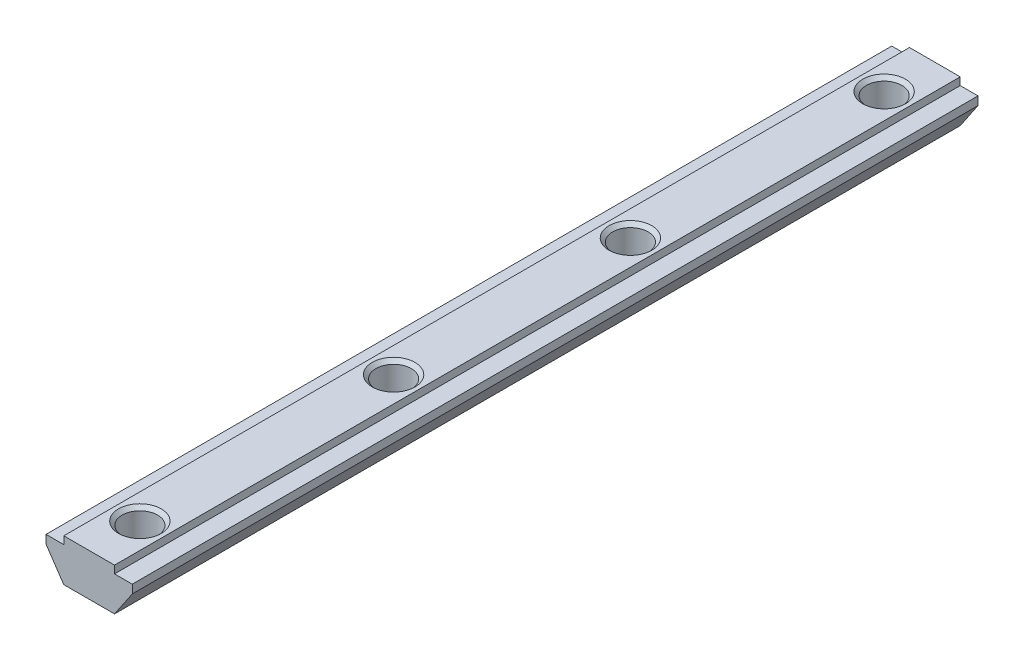
ISO-10303-21;
HEADER;
FILE_DESCRIPTION(('STEP AP214'),'2;1');
FILE_NAME('part.step','',(''),(''),'','','');
FILE_SCHEMA(('AUTOMOTIVE_DESIGN { 1 0 10303 214 1 1 1 1 }'));
ENDSEC;
DATA;
#1=APPLICATION_CONTEXT('core data for automotive mechanical design processes');
#2=APPLICATION_PROTOCOL_DEFINITION('international standard','automotive_design',2000,#1);
#3=PRODUCT_CONTEXT('',#1,'mechanical');
#4=PRODUCT('Part','Part','',(#3));
#5=PRODUCT_RELATED_PRODUCT_CATEGORY('part','',(#4));
#6=PRODUCT_DEFINITION_FORMATION('','',#4);
#7=PRODUCT_DEFINITION_CONTEXT('part definition',#1,'design');
#8=PRODUCT_DEFINITION('design','',#6,#7);
#9=PRODUCT_DEFINITION_SHAPE('','',#8);
#10=(LENGTH_UNIT() NAMED_UNIT(*) SI_UNIT(.MILLI.,.METRE.));
#11=(NAMED_UNIT(*) PLANE_ANGLE_UNIT() SI_UNIT($,.RADIAN.));
#12=(NAMED_UNIT(*) SI_UNIT($,.STERADIAN.) SOLID_ANGLE_UNIT());
#13=UNCERTAINTY_MEASURE_WITH_UNIT(LENGTH_MEASURE(1.E-05),#10,'distance_accuracy_value','');
#14=(GEOMETRIC_REPRESENTATION_CONTEXT(3) GLOBAL_UNCERTAINTY_ASSIGNED_CONTEXT((#13)) GLOBAL_UNIT_ASSIGNED_CONTEXT((#10,
#11,#12)) REPRESENTATION_CONTEXT('',''));
#15=CARTESIAN_POINT('',(0.,0.,0.));
#16=DIRECTION('',(0.,0.,1.));
#17=DIRECTION('',(1.,0.,0.));
#18=AXIS2_PLACEMENT_3D('',#15,#16,#17);
#19=CARTESIAN_POINT('',(3.,0.,50.));
#20=DIRECTION('',(0.,-1.,0.));
#21=DIRECTION('',(0.,0.,-1.));
#22=AXIS2_PLACEMENT_3D('',#19,#20,#21);
#23=PLANE('',#22);
#24=CARTESIAN_POINT('',(0.,0.,-44.));
#25=DIRECTION('',(0.,1.,0.));
#26=DIRECTION('',(0.,0.,1.));
#27=AXIS2_PLACEMENT_3D('',#24,#25,#26);
#28=CIRCLE('',#27,2.525);
#29=CARTESIAN_POINT('',(0.,0.,-41.475));
#30=VERTEX_POINT('',#29);
#31=EDGE_CURVE('E253',#30,#30,#28,.T.);
#32=ORIENTED_EDGE('',*,*,#31,.F.);
#33=EDGE_LOOP('',(#32));
#34=FACE_BOUND('',#33,.T.);
#35=CARTESIAN_POINT('',(0.,0.,14.));
#36=DIRECTION('',(0.,1.,0.));
#37=DIRECTION('',(0.,0.,1.));
#38=AXIS2_PLACEMENT_3D('',#35,#36,#37);
#39=CIRCLE('',#38,2.525);
#40=CARTESIAN_POINT('',(0.,0.,16.525));
#41=VERTEX_POINT('',#40);
#42=EDGE_CURVE('E229',#41,#41,#39,.T.);
#43=ORIENTED_EDGE('',*,*,#42,.F.);
#44=EDGE_LOOP('',(#43));
#45=FACE_BOUND('',#44,.T.);
#46=CARTESIAN_POINT('',(0.,0.,44.));
#47=DIRECTION('',(0.,1.,0.));
#48=DIRECTION('',(0.,0.,1.));
#49=AXIS2_PLACEMENT_3D('',#46,#47,#48);
#50=CIRCLE('',#49,2.525);
#51=CARTESIAN_POINT('',(0.,0.,46.525));
#52=VERTEX_POINT('',#51);
#53=EDGE_CURVE('E217',#52,#52,#50,.T.);
#54=ORIENTED_EDGE('',*,*,#53,.F.);
#55=EDGE_LOOP('',(#54));
#56=FACE_BOUND('',#55,.T.);
#57=DIRECTION('',(-1.,0.,0.));
#58=VECTOR('',#57,1.);
#59=CARTESIAN_POINT('',(3.,0.,-50.));
#60=LINE('',#59,#58);
#61=CARTESIAN_POINT('',(3.,0.,-50.));
#62=VERTEX_POINT('',#61);
#63=CARTESIAN_POINT('',(-3.,0.,-50.));
#64=VERTEX_POINT('',#63);
#65=EDGE_CURVE('E95',#62,#64,#60,.T.);
#66=ORIENTED_EDGE('',*,*,#65,.T.);
#67=DIRECTION('',(0.,0.,-1.));
#68=VECTOR('',#67,1.);
#69=CARTESIAN_POINT('',(-3.,0.,50.));
#70=LINE('',#69,#68);
#71=CARTESIAN_POINT('',(-3.,0.,50.));
#72=VERTEX_POINT('',#71);
#73=EDGE_CURVE('E142',#72,#64,#70,.T.);
#74=ORIENTED_EDGE('',*,*,#73,.F.);
#75=DIRECTION('',(-1.,0.,0.));
#76=VECTOR('',#75,1.);
#77=CARTESIAN_POINT('',(3.,0.,50.));
#78=LINE('',#77,#76);
#79=CARTESIAN_POINT('',(3.,0.,50.));
#80=VERTEX_POINT('',#79);
#81=EDGE_CURVE('E54',#80,#72,#78,.T.);
#82=ORIENTED_EDGE('',*,*,#81,.F.);
#83=DIRECTION('',(0.,0.,-1.));
#84=VECTOR('',#83,1.);
#85=CARTESIAN_POINT('',(3.,0.,50.));
#86=LINE('',#85,#84);
#87=EDGE_CURVE('E138',#80,#62,#86,.T.);
#88=ORIENTED_EDGE('',*,*,#87,.T.);
#89=EDGE_LOOP('',(#66,#74,#82,#88));
#90=FACE_BOUND('',#89,.T.);
#91=CARTESIAN_POINT('',(0.,0.,-14.));
#92=DIRECTION('',(0.,1.,0.));
#93=DIRECTION('',(0.,0.,1.));
#94=AXIS2_PLACEMENT_3D('',#91,#92,#93);
#95=CIRCLE('',#94,2.525);
#96=CARTESIAN_POINT('',(0.,0.,-11.475));
#97=VERTEX_POINT('',#96);
#98=EDGE_CURVE('E241',#97,#97,#95,.T.);
#99=ORIENTED_EDGE('',*,*,#98,.F.);
#100=EDGE_LOOP('',(#99));
#101=FACE_BOUND('',#100,.T.);
#102=ADVANCED_FACE('F37',(#34,#45,#56,#90,#101),#23,.F.);
#103=CARTESIAN_POINT('',(-3.,0.,50.));
#104=DIRECTION('',(1.,0.,0.));
#105=DIRECTION('',(0.,1.,0.));
#106=AXIS2_PLACEMENT_3D('',#103,#104,#105);
#107=PLANE('',#106);
#108=DIRECTION('',(0.,-1.,0.));
#109=VECTOR('',#108,1.);
#110=CARTESIAN_POINT('',(-3.,0.,-50.));
#111=LINE('',#110,#109);
#112=CARTESIAN_POINT('',(-3.,-0.900000000000001,-50.));
#113=VERTEX_POINT('',#112);
#114=EDGE_CURVE('E146',#64,#113,#111,.T.);
#115=ORIENTED_EDGE('',*,*,#114,.T.);
#116=DIRECTION('',(0.,0.,-1.));
#117=VECTOR('',#116,1.);
#118=CARTESIAN_POINT('',(-3.,-0.900000000000001,50.));
#119=LINE('',#118,#117);
#120=CARTESIAN_POINT('',(-3.,-0.900000000000001,50.));
#121=VERTEX_POINT('',#120);
#122=EDGE_CURVE('E11',#121,#113,#119,.T.);
#123=ORIENTED_EDGE('',*,*,#122,.F.);
#124=DIRECTION('',(0.,-1.,0.));
#125=VECTOR('',#124,1.);
#126=CARTESIAN_POINT('',(-3.,0.,50.));
#127=LINE('',#126,#125);
#128=EDGE_CURVE('E165',#72,#121,#127,.T.);
#129=ORIENTED_EDGE('',*,*,#128,.F.);
#130=ORIENTED_EDGE('',*,*,#73,.T.);
#131=EDGE_LOOP('',(#115,#123,#129,#130));
#132=FACE_BOUND('',#131,.T.);
#133=ADVANCED_FACE('F39',(#132),#107,.F.);
#134=CARTESIAN_POINT('',(-3.,-0.900000000000001,50.));
#135=DIRECTION('',(0.,-1.,0.));
#136=DIRECTION('',(1.,0.,0.));
#137=AXIS2_PLACEMENT_3D('',#134,#135,#136);
#138=PLANE('',#137);
#139=DIRECTION('',(-1.,0.,0.));
#140=VECTOR('',#139,1.);
#141=CARTESIAN_POINT('',(-3.,-0.900000000000001,-50.));
#142=LINE('',#141,#140);
#143=CARTESIAN_POINT('',(-5.1,-0.900000000000002,-50.));
#144=VERTEX_POINT('',#143);
#145=EDGE_CURVE('E149',#113,#144,#142,.T.);
#146=ORIENTED_EDGE('',*,*,#145,.T.);
#147=DIRECTION('',(0.,0.,-1.));
#148=VECTOR('',#147,1.);
#149=CARTESIAN_POINT('',(-5.1,-0.900000000000002,50.));
#150=LINE('',#149,#148);
#151=CARTESIAN_POINT('',(-5.1,-0.900000000000002,50.));
#152=VERTEX_POINT('',#151);
#153=EDGE_CURVE('E46',#152,#144,#150,.T.);
#154=ORIENTED_EDGE('',*,*,#153,.F.);
#155=DIRECTION('',(-1.,0.,0.));
#156=VECTOR('',#155,1.);
#157=CARTESIAN_POINT('',(-3.,-0.900000000000001,50.));
#158=LINE('',#157,#156);
#159=EDGE_CURVE('E103',#121,#152,#158,.T.);
#160=ORIENTED_EDGE('',*,*,#159,.F.);
#161=ORIENTED_EDGE('',*,*,#122,.T.);
#162=EDGE_LOOP('',(#146,#154,#160,#161));
#163=FACE_BOUND('',#162,.T.);
#164=ADVANCED_FACE('F350',(#163),#138,.F.);
#165=CARTESIAN_POINT('',(-5.1,-0.900000000000002,50.));
#166=DIRECTION('',(1.,0.,0.));
#167=DIRECTION('',(0.,0.,-1.));
#168=AXIS2_PLACEMENT_3D('',#165,#166,#167);
#169=PLANE('',#168);
#170=DIRECTION('',(0.,-1.,0.));
#171=VECTOR('',#170,1.);
#172=CARTESIAN_POINT('',(-5.1,-0.900000000000002,-50.));
#173=LINE('',#172,#171);
#174=CARTESIAN_POINT('',(-5.1,-1.9,-50.));
#175=VERTEX_POINT('',#174);
#176=EDGE_CURVE('E152',#144,#175,#173,.T.);
#177=ORIENTED_EDGE('',*,*,#176,.T.);
#178=DIRECTION('',(0.,0.,-1.));
#179=VECTOR('',#178,1.);
#180=CARTESIAN_POINT('',(-5.1,-1.9,50.));
#181=LINE('',#180,#179);
#182=CARTESIAN_POINT('',(-5.1,-1.9,50.));
#183=VERTEX_POINT('',#182);
#184=EDGE_CURVE('E178',#183,#175,#181,.T.);
#185=ORIENTED_EDGE('',*,*,#184,.F.);
#186=DIRECTION('',(0.,-1.,0.));
#187=VECTOR('',#186,1.);
#188=CARTESIAN_POINT('',(-5.1,-0.900000000000002,50.));
#189=LINE('',#188,#187);
#190=EDGE_CURVE('E186',#152,#183,#189,.T.);
#191=ORIENTED_EDGE('',*,*,#190,.F.);
#192=ORIENTED_EDGE('',*,*,#153,.T.);
#193=EDGE_LOOP('',(#177,#185,#191,#192));
#194=FACE_BOUND('',#193,.T.);
#195=ADVANCED_FACE('F184',(#194),#169,.F.);
#196=CARTESIAN_POINT('',(-5.1,-1.9,50.));
#197=DIRECTION('',(0.827918690488332,0.560848145169516,0.));
#198=DIRECTION('',(-0.560848145169516,0.827918690488332,0.));
#199=AXIS2_PLACEMENT_3D('',#196,#197,#198);
#200=PLANE('',#199);
#201=DIRECTION('',(0.560848145169516,-0.827918690488332,0.));
#202=VECTOR('',#201,1.);
#203=CARTESIAN_POINT('',(-5.1,-1.9,-50.));
#204=LINE('',#203,#202);
#205=CARTESIAN_POINT('',(-3.,-5.,-50.));
#206=VERTEX_POINT('',#205);
#207=EDGE_CURVE('E154',#175,#206,#204,.T.);
#208=ORIENTED_EDGE('',*,*,#207,.T.);
#209=DIRECTION('',(0.,0.,-1.));
#210=VECTOR('',#209,1.);
#211=CARTESIAN_POINT('',(-3.,-5.,50.));
#212=LINE('',#211,#210);
#213=CARTESIAN_POINT('',(-3.,-5.,50.));
#214=VERTEX_POINT('',#213);
#215=EDGE_CURVE('E175',#214,#206,#212,.T.);
#216=ORIENTED_EDGE('',*,*,#215,.F.);
#217=DIRECTION('',(0.560848145169516,-0.827918690488332,0.));
#218=VECTOR('',#217,1.);
#219=CARTESIAN_POINT('',(-5.1,-1.9,50.));
#220=LINE('',#219,#218);
#221=EDGE_CURVE('E204',#183,#214,#220,.T.);
#222=ORIENTED_EDGE('',*,*,#221,.F.);
#223=ORIENTED_EDGE('',*,*,#184,.T.);
#224=EDGE_LOOP('',(#208,#216,#222,#223));
#225=FACE_BOUND('',#224,.T.);
#226=ADVANCED_FACE('F195',(#225),#200,.F.);
#227=CARTESIAN_POINT('',(-3.,-5.,50.));
#228=DIRECTION('',(0.,1.,0.));
#229=DIRECTION('',(0.,0.,1.));
#230=AXIS2_PLACEMENT_3D('',#227,#228,#229);
#231=PLANE('',#230);
#232=CARTESIAN_POINT('',(0.,-5.,-44.));
#233=DIRECTION('',(0.,1.,0.));
#234=DIRECTION('',(0.,0.,1.));
#235=AXIS2_PLACEMENT_3D('',#232,#233,#234);
#236=CIRCLE('',#235,2.525);
#237=CARTESIAN_POINT('',(0.,-5.,-41.475));
#238=VERTEX_POINT('',#237);
#239=EDGE_CURVE('E256',#238,#238,#236,.T.);
#240=ORIENTED_EDGE('',*,*,#239,.T.);
#241=EDGE_LOOP('',(#240));
#242=FACE_BOUND('',#241,.T.);
#243=CARTESIAN_POINT('',(0.,-5.,-14.));
#244=DIRECTION('',(0.,1.,0.));
#245=DIRECTION('',(0.,0.,1.));
#246=AXIS2_PLACEMENT_3D('',#243,#244,#245);
#247=CIRCLE('',#246,2.525);
#248=CARTESIAN_POINT('',(0.,-5.,-11.475));
#249=VERTEX_POINT('',#248);
#250=EDGE_CURVE('E244',#249,#249,#247,.T.);
#251=ORIENTED_EDGE('',*,*,#250,.T.);
#252=EDGE_LOOP('',(#251));
#253=FACE_BOUND('',#252,.T.);
#254=CARTESIAN_POINT('',(0.,-5.,14.));
#255=DIRECTION('',(0.,1.,0.));
#256=DIRECTION('',(0.,0.,1.));
#257=AXIS2_PLACEMENT_3D('',#254,#255,#256);
#258=CIRCLE('',#257,2.525);
#259=CARTESIAN_POINT('',(0.,-5.,16.525));
#260=VERTEX_POINT('',#259);
#261=EDGE_CURVE('E232',#260,#260,#258,.T.);
#262=ORIENTED_EDGE('',*,*,#261,.T.);
#263=EDGE_LOOP('',(#262));
#264=FACE_BOUND('',#263,.T.);
#265=CARTESIAN_POINT('',(0.,-5.,44.));
#266=DIRECTION('',(0.,1.,0.));
#267=DIRECTION('',(0.,0.,1.));
#268=AXIS2_PLACEMENT_3D('',#265,#266,#267);
#269=CIRCLE('',#268,2.525);
#270=CARTESIAN_POINT('',(0.,-5.,46.525));
#271=VERTEX_POINT('',#270);
#272=EDGE_CURVE('E220',#271,#271,#269,.T.);
#273=ORIENTED_EDGE('',*,*,#272,.T.);
#274=EDGE_LOOP('',(#273));
#275=FACE_BOUND('',#274,.T.);
#276=DIRECTION('',(1.,0.,0.));
#277=VECTOR('',#276,1.);
#278=CARTESIAN_POINT('',(-3.,-5.,-50.));
#279=LINE('',#278,#277);
#280=CARTESIAN_POINT('',(3.,-5.,-50.));
#281=VERTEX_POINT('',#280);
#282=EDGE_CURVE('E156',#206,#281,#279,.T.);
#283=ORIENTED_EDGE('',*,*,#282,.T.);
#284=DIRECTION('',(0.,0.,-1.));
#285=VECTOR('',#284,1.);
#286=CARTESIAN_POINT('',(3.,-5.,50.));
#287=LINE('',#286,#285);
#288=CARTESIAN_POINT('',(3.,-5.,50.));
#289=VERTEX_POINT('',#288);
#290=EDGE_CURVE('E172',#289,#281,#287,.T.);
#291=ORIENTED_EDGE('',*,*,#290,.F.);
#292=DIRECTION('',(1.,0.,0.));
#293=VECTOR('',#292,1.);
#294=CARTESIAN_POINT('',(-3.,-5.,50.));
#295=LINE('',#294,#293);
#296=EDGE_CURVE('E201',#214,#289,#295,.T.);
#297=ORIENTED_EDGE('',*,*,#296,.F.);
#298=ORIENTED_EDGE('',*,*,#215,.T.);
#299=EDGE_LOOP('',(#283,#291,#297,#298));
#300=FACE_BOUND('',#299,.T.);
#301=ADVANCED_FACE('F199',(#242,#253,#264,#275,#300),#231,.F.);
#302=CARTESIAN_POINT('',(5.1,-1.9,50.));
#303=DIRECTION('',(-0.827918690488332,0.560848145169516,0.));
#304=DIRECTION('',(-0.560848145169516,-0.827918690488332,0.));
#305=AXIS2_PLACEMENT_3D('',#302,#303,#304);
#306=PLANE('',#305);
#307=DIRECTION('',(0.560848145169516,0.827918690488332,0.));
#308=VECTOR('',#307,1.);
#309=CARTESIAN_POINT('',(5.1,-1.9,-50.));
#310=LINE('',#309,#308);
#311=CARTESIAN_POINT('',(5.1,-1.9,-50.));
#312=VERTEX_POINT('',#311);
#313=EDGE_CURVE('E158',#281,#312,#310,.T.);
#314=ORIENTED_EDGE('',*,*,#313,.T.);
#315=DIRECTION('',(0.,0.,-1.));
#316=VECTOR('',#315,1.);
#317=CARTESIAN_POINT('',(5.1,-1.9,50.));
#318=LINE('',#317,#316);
#319=CARTESIAN_POINT('',(5.1,-1.9,50.));
#320=VERTEX_POINT('',#319);
#321=EDGE_CURVE('E169',#320,#312,#318,.T.);
#322=ORIENTED_EDGE('',*,*,#321,.F.);
#323=DIRECTION('',(0.560848145169516,0.827918690488332,0.));
#324=VECTOR('',#323,1.);
#325=CARTESIAN_POINT('',(5.1,-1.9,50.));
#326=LINE('',#325,#324);
#327=EDGE_CURVE('E203',#289,#320,#326,.T.);
#328=ORIENTED_EDGE('',*,*,#327,.F.);
#329=ORIENTED_EDGE('',*,*,#290,.T.);
#330=EDGE_LOOP('',(#314,#322,#328,#329));
#331=FACE_BOUND('',#330,.T.);
#332=ADVANCED_FACE('F340',(#331),#306,.F.);
#333=CARTESIAN_POINT('',(5.1,-0.900000000000002,50.));
#334=DIRECTION('',(-1.,0.,0.));
#335=DIRECTION('',(0.,0.,1.));
#336=AXIS2_PLACEMENT_3D('',#333,#334,#335);
#337=PLANE('',#336);
#338=DIRECTION('',(0.,1.,0.));
#339=VECTOR('',#338,1.);
#340=CARTESIAN_POINT('',(5.1,-0.900000000000002,-50.));
#341=LINE('',#340,#339);
#342=CARTESIAN_POINT('',(5.1,-0.900000000000002,-50.));
#343=VERTEX_POINT('',#342);
#344=EDGE_CURVE('E160',#312,#343,#341,.T.);
#345=ORIENTED_EDGE('',*,*,#344,.T.);
#346=DIRECTION('',(0.,0.,-1.));
#347=VECTOR('',#346,1.);
#348=CARTESIAN_POINT('',(5.1,-0.900000000000002,50.));
#349=LINE('',#348,#347);
#350=CARTESIAN_POINT('',(5.1,-0.900000000000002,50.));
#351=VERTEX_POINT('',#350);
#352=EDGE_CURVE('E137',#351,#343,#349,.T.);
#353=ORIENTED_EDGE('',*,*,#352,.F.);
#354=DIRECTION('',(0.,1.,0.));
#355=VECTOR('',#354,1.);
#356=CARTESIAN_POINT('',(5.1,-0.900000000000002,50.));
#357=LINE('',#356,#355);
#358=EDGE_CURVE('E128',#320,#351,#357,.T.);
#359=ORIENTED_EDGE('',*,*,#358,.F.);
#360=ORIENTED_EDGE('',*,*,#321,.T.);
#361=EDGE_LOOP('',(#345,#353,#359,#360));
#362=FACE_BOUND('',#361,.T.);
#363=ADVANCED_FACE('F337',(#362),#337,.F.);
#364=CARTESIAN_POINT('',(3.,-0.900000000000001,50.));
#365=DIRECTION('',(0.,-1.,0.));
#366=DIRECTION('',(1.,0.,0.));
#367=AXIS2_PLACEMENT_3D('',#364,#365,#366);
#368=PLANE('',#367);
#369=DIRECTION('',(-1.,0.,0.));
#370=VECTOR('',#369,1.);
#371=CARTESIAN_POINT('',(3.,-0.900000000000001,-50.));
#372=LINE('',#371,#370);
#373=CARTESIAN_POINT('',(3.,-0.900000000000001,-50.));
#374=VERTEX_POINT('',#373);
#375=EDGE_CURVE('E136',#343,#374,#372,.T.);
#376=ORIENTED_EDGE('',*,*,#375,.T.);
#377=DIRECTION('',(0.,0.,-1.));
#378=VECTOR('',#377,1.);
#379=CARTESIAN_POINT('',(3.,-0.900000000000001,50.));
#380=LINE('',#379,#378);
#381=CARTESIAN_POINT('',(3.,-0.900000000000001,50.));
#382=VERTEX_POINT('',#381);
#383=EDGE_CURVE('E133',#382,#374,#380,.T.);
#384=ORIENTED_EDGE('',*,*,#383,.F.);
#385=DIRECTION('',(-1.,0.,0.));
#386=VECTOR('',#385,1.);
#387=CARTESIAN_POINT('',(3.,-0.900000000000001,50.));
#388=LINE('',#387,#386);
#389=EDGE_CURVE('E122',#351,#382,#388,.T.);
#390=ORIENTED_EDGE('',*,*,#389,.F.);
#391=ORIENTED_EDGE('',*,*,#352,.T.);
#392=EDGE_LOOP('',(#376,#384,#390,#391));
#393=FACE_BOUND('',#392,.T.);
#394=ADVANCED_FACE('F134',(#393),#368,.F.);
#395=CARTESIAN_POINT('',(3.,0.,50.));
#396=DIRECTION('',(-1.,0.,0.));
#397=DIRECTION('',(0.,-1.,0.));
#398=AXIS2_PLACEMENT_3D('',#395,#396,#397);
#399=PLANE('',#398);
#400=DIRECTION('',(0.,1.,0.));
#401=VECTOR('',#400,1.);
#402=CARTESIAN_POINT('',(3.,0.,-50.));
#403=LINE('',#402,#401);
#404=EDGE_CURVE('E89',#374,#62,#403,.T.);
#405=ORIENTED_EDGE('',*,*,#404,.T.);
#406=ORIENTED_EDGE('',*,*,#87,.F.);
#407=DIRECTION('',(0.,1.,0.));
#408=VECTOR('',#407,1.);
#409=CARTESIAN_POINT('',(3.,0.,50.));
#410=LINE('',#409,#408);
#411=EDGE_CURVE('E126',#382,#80,#410,.T.);
#412=ORIENTED_EDGE('',*,*,#411,.F.);
#413=ORIENTED_EDGE('',*,*,#383,.T.);
#414=EDGE_LOOP('',(#405,#406,#412,#413));
#415=FACE_BOUND('',#414,.T.);
#416=ADVANCED_FACE('F140',(#415),#399,.F.);
#417=CARTESIAN_POINT('',(0.,0.,50.));
#418=DIRECTION('',(0.,0.,-1.));
#419=DIRECTION('',(-1.,0.,0.));
#420=AXIS2_PLACEMENT_3D('',#417,#418,#419);
#421=PLANE('',#420);
#422=ORIENTED_EDGE('',*,*,#128,.T.);
#423=ORIENTED_EDGE('',*,*,#159,.T.);
#424=ORIENTED_EDGE('',*,*,#190,.T.);
#425=ORIENTED_EDGE('',*,*,#221,.T.);
#426=ORIENTED_EDGE('',*,*,#296,.T.);
#427=ORIENTED_EDGE('',*,*,#327,.T.);
#428=ORIENTED_EDGE('',*,*,#358,.T.);
#429=ORIENTED_EDGE('',*,*,#389,.T.);
#430=ORIENTED_EDGE('',*,*,#411,.T.);
#431=ORIENTED_EDGE('',*,*,#81,.T.);
#432=EDGE_LOOP('',(#422,#423,#424,#425,#426,#427,#428,#429,#430,#431));
#433=FACE_BOUND('',#432,.T.);
#434=ADVANCED_FACE('F124',(#433),#421,.F.);
#435=CARTESIAN_POINT('',(0.,0.,-50.));
#436=DIRECTION('',(0.,0.,-1.));
#437=DIRECTION('',(-1.,0.,0.));
#438=AXIS2_PLACEMENT_3D('',#435,#436,#437);
#439=PLANE('',#438);
#440=ORIENTED_EDGE('',*,*,#114,.F.);
#441=ORIENTED_EDGE('',*,*,#65,.F.);
#442=ORIENTED_EDGE('',*,*,#404,.F.);
#443=ORIENTED_EDGE('',*,*,#375,.F.);
#444=ORIENTED_EDGE('',*,*,#344,.F.);
#445=ORIENTED_EDGE('',*,*,#313,.F.);
#446=ORIENTED_EDGE('',*,*,#282,.F.);
#447=ORIENTED_EDGE('',*,*,#207,.F.);
#448=ORIENTED_EDGE('',*,*,#176,.F.);
#449=ORIENTED_EDGE('',*,*,#145,.F.);
#450=EDGE_LOOP('',(#440,#441,#442,#443,#444,#445,#446,#447,#448,#449));
#451=FACE_BOUND('',#450,.T.);
#452=ADVANCED_FACE('F190',(#451),#439,.T.);
#453=CARTESIAN_POINT('',(0.,-4.575,44.));
#454=DIRECTION('',(0.,-1.,0.));
#455=DIRECTION('',(0.,0.,-1.));
#456=AXIS2_PLACEMENT_3D('',#453,#454,#455);
#457=CONICAL_SURFACE('',#456,2.1,0.785398163397447);
#458=ORIENTED_EDGE('',*,*,#272,.F.);
#459=EDGE_LOOP('',(#458));
#460=FACE_BOUND('',#459,.T.);
#461=CARTESIAN_POINT('',(0.,-4.575,44.));
#462=DIRECTION('',(0.,1.,0.));
#463=DIRECTION('',(0.,0.,1.));
#464=AXIS2_PLACEMENT_3D('',#461,#462,#463);
#465=CIRCLE('',#464,2.1);
#466=CARTESIAN_POINT('',(0.,-4.575,46.1));
#467=VERTEX_POINT('',#466);
#468=EDGE_CURVE('E150',#467,#467,#465,.T.);
#469=ORIENTED_EDGE('',*,*,#468,.T.);
#470=EDGE_LOOP('',(#469));
#471=FACE_BOUND('',#470,.T.);
#472=ADVANCED_FACE('F324',(#460,#471),#457,.F.);
#473=CARTESIAN_POINT('',(0.,0.,44.));
#474=DIRECTION('',(0.,1.,0.));
#475=DIRECTION('',(0.,0.,1.));
#476=AXIS2_PLACEMENT_3D('',#473,#474,#475);
#477=CYLINDRICAL_SURFACE('',#476,2.1);
#478=ORIENTED_EDGE('',*,*,#468,.F.);
#479=EDGE_LOOP('',(#478));
#480=FACE_BOUND('',#479,.T.);
#481=CARTESIAN_POINT('',(0.,-0.425,44.));
#482=DIRECTION('',(0.,1.,0.));
#483=DIRECTION('',(0.,0.,1.));
#484=AXIS2_PLACEMENT_3D('',#481,#482,#483);
#485=CIRCLE('',#484,2.1);
#486=CARTESIAN_POINT('',(0.,-0.425,46.1));
#487=VERTEX_POINT('',#486);
#488=EDGE_CURVE('E214',#487,#487,#485,.T.);
#489=ORIENTED_EDGE('',*,*,#488,.T.);
#490=EDGE_LOOP('',(#489));
#491=FACE_BOUND('',#490,.T.);
#492=ADVANCED_FACE('F320',(#480,#491),#477,.F.);
#493=CARTESIAN_POINT('',(0.,0.,44.));
#494=DIRECTION('',(0.,1.,0.));
#495=DIRECTION('',(0.,0.,1.));
#496=AXIS2_PLACEMENT_3D('',#493,#494,#495);
#497=CONICAL_SURFACE('',#496,2.525,0.785398163397449);
#498=ORIENTED_EDGE('',*,*,#488,.F.);
#499=EDGE_LOOP('',(#498));
#500=FACE_BOUND('',#499,.T.);
#501=ORIENTED_EDGE('',*,*,#53,.T.);
#502=EDGE_LOOP('',(#501));
#503=FACE_BOUND('',#502,.T.);
#504=ADVANCED_FACE('F316',(#500,#503),#497,.F.);
#505=CARTESIAN_POINT('',(0.,-4.575,14.));
#506=DIRECTION('',(0.,-1.,0.));
#507=DIRECTION('',(0.,0.,-1.));
#508=AXIS2_PLACEMENT_3D('',#505,#506,#507);
#509=CONICAL_SURFACE('',#508,2.1,0.785398163397447);
#510=ORIENTED_EDGE('',*,*,#261,.F.);
#511=EDGE_LOOP('',(#510));
#512=FACE_BOUND('',#511,.T.);
#513=CARTESIAN_POINT('',(0.,-4.575,14.));
#514=DIRECTION('',(0.,1.,0.));
#515=DIRECTION('',(0.,0.,1.));
#516=AXIS2_PLACEMENT_3D('',#513,#514,#515);
#517=CIRCLE('',#516,2.1);
#518=CARTESIAN_POINT('',(0.,-4.575,16.1));
#519=VERTEX_POINT('',#518);
#520=EDGE_CURVE('E223',#519,#519,#517,.T.);
#521=ORIENTED_EDGE('',*,*,#520,.T.);
#522=EDGE_LOOP('',(#521));
#523=FACE_BOUND('',#522,.T.);
#524=ADVANCED_FACE('F312',(#512,#523),#509,.F.);
#525=CARTESIAN_POINT('',(0.,0.,14.));
#526=DIRECTION('',(0.,1.,0.));
#527=DIRECTION('',(0.,0.,1.));
#528=AXIS2_PLACEMENT_3D('',#525,#526,#527);
#529=CYLINDRICAL_SURFACE('',#528,2.1);
#530=ORIENTED_EDGE('',*,*,#520,.F.);
#531=EDGE_LOOP('',(#530));
#532=FACE_BOUND('',#531,.T.);
#533=CARTESIAN_POINT('',(0.,-0.425,14.));
#534=DIRECTION('',(0.,1.,0.));
#535=DIRECTION('',(0.,0.,1.));
#536=AXIS2_PLACEMENT_3D('',#533,#534,#535);
#537=CIRCLE('',#536,2.1);
#538=CARTESIAN_POINT('',(0.,-0.425,16.1));
#539=VERTEX_POINT('',#538);
#540=EDGE_CURVE('E226',#539,#539,#537,.T.);
#541=ORIENTED_EDGE('',*,*,#540,.T.);
#542=EDGE_LOOP('',(#541));
#543=FACE_BOUND('',#542,.T.);
#544=ADVANCED_FACE('F308',(#532,#543),#529,.F.);
#545=CARTESIAN_POINT('',(0.,0.,14.));
#546=DIRECTION('',(0.,1.,0.));
#547=DIRECTION('',(0.,0.,1.));
#548=AXIS2_PLACEMENT_3D('',#545,#546,#547);
#549=CONICAL_SURFACE('',#548,2.525,0.785398163397449);
#550=ORIENTED_EDGE('',*,*,#540,.F.);
#551=EDGE_LOOP('',(#550));
#552=FACE_BOUND('',#551,.T.);
#553=ORIENTED_EDGE('',*,*,#42,.T.);
#554=EDGE_LOOP('',(#553));
#555=FACE_BOUND('',#554,.T.);
#556=ADVANCED_FACE('F304',(#552,#555),#549,.F.);
#557=CARTESIAN_POINT('',(0.,-4.575,-14.));
#558=DIRECTION('',(0.,-1.,0.));
#559=DIRECTION('',(0.,0.,-1.));
#560=AXIS2_PLACEMENT_3D('',#557,#558,#559);
#561=CONICAL_SURFACE('',#560,2.1,0.785398163397447);
#562=ORIENTED_EDGE('',*,*,#250,.F.);
#563=EDGE_LOOP('',(#562));
#564=FACE_BOUND('',#563,.T.);
#565=CARTESIAN_POINT('',(0.,-4.575,-14.));
#566=DIRECTION('',(0.,1.,0.));
#567=DIRECTION('',(0.,0.,1.));
#568=AXIS2_PLACEMENT_3D('',#565,#566,#567);
#569=CIRCLE('',#568,2.1);
#570=CARTESIAN_POINT('',(0.,-4.575,-11.9));
#571=VERTEX_POINT('',#570);
#572=EDGE_CURVE('E235',#571,#571,#569,.T.);
#573=ORIENTED_EDGE('',*,*,#572,.T.);
#574=EDGE_LOOP('',(#573));
#575=FACE_BOUND('',#574,.T.);
#576=ADVANCED_FACE('F297',(#564,#575),#561,.F.);
#577=CARTESIAN_POINT('',(0.,0.,-14.));
#578=DIRECTION('',(0.,1.,0.));
#579=DIRECTION('',(0.,0.,1.));
#580=AXIS2_PLACEMENT_3D('',#577,#578,#579);
#581=CYLINDRICAL_SURFACE('',#580,2.1);
#582=ORIENTED_EDGE('',*,*,#572,.F.);
#583=EDGE_LOOP('',(#582));
#584=FACE_BOUND('',#583,.T.);
#585=CARTESIAN_POINT('',(0.,-0.425,-14.));
#586=DIRECTION('',(0.,1.,0.));
#587=DIRECTION('',(0.,0.,1.));
#588=AXIS2_PLACEMENT_3D('',#585,#586,#587);
#589=CIRCLE('',#588,2.1);
#590=CARTESIAN_POINT('',(0.,-0.425,-11.9));
#591=VERTEX_POINT('',#590);
#592=EDGE_CURVE('E238',#591,#591,#589,.T.);
#593=ORIENTED_EDGE('',*,*,#592,.T.);
#594=EDGE_LOOP('',(#593));
#595=FACE_BOUND('',#594,.T.);
#596=ADVANCED_FACE('F291',(#584,#595),#581,.F.);
#597=CARTESIAN_POINT('',(0.,0.,-14.));
#598=DIRECTION('',(0.,1.,0.));
#599=DIRECTION('',(0.,0.,1.));
#600=AXIS2_PLACEMENT_3D('',#597,#598,#599);
#601=CONICAL_SURFACE('',#600,2.525,0.785398163397449);
#602=ORIENTED_EDGE('',*,*,#592,.F.);
#603=EDGE_LOOP('',(#602));
#604=FACE_BOUND('',#603,.T.);
#605=ORIENTED_EDGE('',*,*,#98,.T.);
#606=EDGE_LOOP('',(#605));
#607=FACE_BOUND('',#606,.T.);
#608=ADVANCED_FACE('F266',(#604,#607),#601,.F.);
#609=CARTESIAN_POINT('',(0.,-4.575,-44.));
#610=DIRECTION('',(0.,-1.,0.));
#611=DIRECTION('',(0.,0.,-1.));
#612=AXIS2_PLACEMENT_3D('',#609,#610,#611);
#613=CONICAL_SURFACE('',#612,2.1,0.785398163397447);
#614=ORIENTED_EDGE('',*,*,#239,.F.);
#615=EDGE_LOOP('',(#614));
#616=FACE_BOUND('',#615,.T.);
#617=CARTESIAN_POINT('',(0.,-4.575,-44.));
#618=DIRECTION('',(0.,1.,0.));
#619=DIRECTION('',(0.,0.,1.));
#620=AXIS2_PLACEMENT_3D('',#617,#618,#619);
#621=CIRCLE('',#620,2.1);
#622=CARTESIAN_POINT('',(0.,-4.575,-41.9));
#623=VERTEX_POINT('',#622);
#624=EDGE_CURVE('E247',#623,#623,#621,.T.);
#625=ORIENTED_EDGE('',*,*,#624,.T.);
#626=EDGE_LOOP('',(#625));
#627=FACE_BOUND('',#626,.T.);
#628=ADVANCED_FACE('F262',(#616,#627),#613,.F.);
#629=CARTESIAN_POINT('',(0.,0.,-44.));
#630=DIRECTION('',(0.,1.,0.));
#631=DIRECTION('',(0.,0.,1.));
#632=AXIS2_PLACEMENT_3D('',#629,#630,#631);
#633=CYLINDRICAL_SURFACE('',#632,2.1);
#634=ORIENTED_EDGE('',*,*,#624,.F.);
#635=EDGE_LOOP('',(#634));
#636=FACE_BOUND('',#635,.T.);
#637=CARTESIAN_POINT('',(0.,-0.425,-44.));
#638=DIRECTION('',(0.,1.,0.));
#639=DIRECTION('',(0.,0.,1.));
#640=AXIS2_PLACEMENT_3D('',#637,#638,#639);
#641=CIRCLE('',#640,2.1);
#642=CARTESIAN_POINT('',(0.,-0.425,-41.9));
#643=VERTEX_POINT('',#642);
#644=EDGE_CURVE('E250',#643,#643,#641,.T.);
#645=ORIENTED_EDGE('',*,*,#644,.T.);
#646=EDGE_LOOP('',(#645));
#647=FACE_BOUND('',#646,.T.);
#648=ADVANCED_FACE('F265',(#636,#647),#633,.F.);
#649=CARTESIAN_POINT('',(0.,0.,-44.));
#650=DIRECTION('',(0.,1.,0.));
#651=DIRECTION('',(0.,0.,1.));
#652=AXIS2_PLACEMENT_3D('',#649,#650,#651);
#653=CONICAL_SURFACE('',#652,2.525,0.785398163397449);
#654=ORIENTED_EDGE('',*,*,#644,.F.);
#655=EDGE_LOOP('',(#654));
#656=FACE_BOUND('',#655,.T.);
#657=ORIENTED_EDGE('',*,*,#31,.T.);
#658=EDGE_LOOP('',(#657));
#659=FACE_BOUND('',#658,.T.);
#660=ADVANCED_FACE('F272',(#656,#659),#653,.F.);
#661=CLOSED_SHELL('',(#102,#133,#164,#195,#226,#301,#332,#363,#394,#416,#434,#452,#472,#492,
#504,#524,#544,#556,#576,#596,#608,#628,#648,#660));
#662=MANIFOLD_SOLID_BREP('B2',#661);
#663=ADVANCED_BREP_SHAPE_REPRESENTATION('',(#18,#662),#14);
#664=SHAPE_DEFINITION_REPRESENTATION(#9,#663);
ENDSEC;
END-ISO-10303-21;
